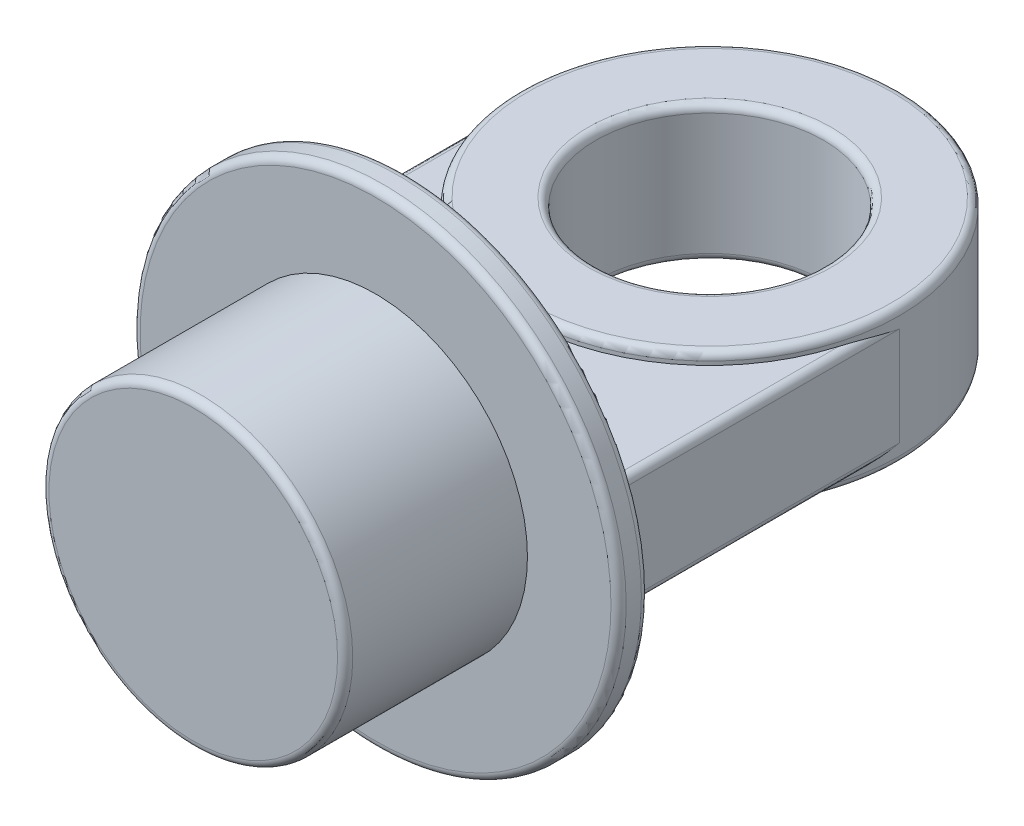
ISO-10303-21;
HEADER;
FILE_DESCRIPTION(('STEP AP214'),'2;1');
FILE_NAME('part.step','',(''),(''),'','','');
FILE_SCHEMA(('AUTOMOTIVE_DESIGN { 1 0 10303 214 1 1 1 1 }'));
ENDSEC;
DATA;
#1=APPLICATION_CONTEXT('core data for automotive mechanical design processes');
#2=APPLICATION_PROTOCOL_DEFINITION('international standard','automotive_design',2000,#1);
#3=PRODUCT_CONTEXT('',#1,'mechanical');
#4=PRODUCT('Part','Part','',(#3));
#5=PRODUCT_RELATED_PRODUCT_CATEGORY('part','',(#4));
#6=PRODUCT_DEFINITION_FORMATION('','',#4);
#7=PRODUCT_DEFINITION_CONTEXT('part definition',#1,'design');
#8=PRODUCT_DEFINITION('design','',#6,#7);
#9=PRODUCT_DEFINITION_SHAPE('','',#8);
#10=(LENGTH_UNIT() NAMED_UNIT(*) SI_UNIT(.MILLI.,.METRE.));
#11=(NAMED_UNIT(*) PLANE_ANGLE_UNIT() SI_UNIT($,.RADIAN.));
#12=(NAMED_UNIT(*) SI_UNIT($,.STERADIAN.) SOLID_ANGLE_UNIT());
#13=UNCERTAINTY_MEASURE_WITH_UNIT(LENGTH_MEASURE(1.E-05),#10,'distance_accuracy_value','');
#14=(GEOMETRIC_REPRESENTATION_CONTEXT(3) GLOBAL_UNCERTAINTY_ASSIGNED_CONTEXT((#13)) GLOBAL_UNIT_ASSIGNED_CONTEXT((#10,
#11,#12)) REPRESENTATION_CONTEXT('',''));
#15=CARTESIAN_POINT('',(0.,0.,0.));
#16=DIRECTION('',(0.,0.,1.));
#17=DIRECTION('',(1.,0.,0.));
#18=AXIS2_PLACEMENT_3D('',#15,#16,#17);
#19=CARTESIAN_POINT('',(0.,-45.,0.));
#20=DIRECTION('',(0.,1.,0.));
#21=DIRECTION('',(0.,0.,1.));
#22=AXIS2_PLACEMENT_3D('',#19,#20,#21);
#23=CYLINDRICAL_SURFACE('',#22,125.);
#24=CARTESIAN_POINT('',(0.,-40.,0.));
#25=DIRECTION('',(0.,-1.,0.));
#26=DIRECTION('',(0.,0.,-1.));
#27=AXIS2_PLACEMENT_3D('',#24,#25,#26);
#28=CIRCLE('',#27,125.);
#29=CARTESIAN_POINT('',(0.,-40.,-125.));
#30=VERTEX_POINT('',#29);
#31=EDGE_CURVE('E146',#30,#30,#28,.F.);
#32=ORIENTED_EDGE('',*,*,#31,.T.);
#33=EDGE_LOOP('',(#32));
#34=FACE_BOUND('',#33,.T.);
#35=CARTESIAN_POINT('',(0.,40.,0.));
#36=DIRECTION('',(0.,-1.,0.));
#37=DIRECTION('',(0.,0.,-1.));
#38=AXIS2_PLACEMENT_3D('',#35,#36,#37);
#39=CIRCLE('',#38,125.);
#40=CARTESIAN_POINT('',(0.,40.,-125.));
#41=VERTEX_POINT('',#40);
#42=EDGE_CURVE('E142',#41,#41,#39,.T.);
#43=ORIENTED_EDGE('',*,*,#42,.T.);
#44=EDGE_LOOP('',(#43));
#45=FACE_BOUND('',#44,.T.);
#46=DIRECTION('',(0.,-1.,0.));
#47=VECTOR('',#46,1.);
#48=CARTESIAN_POINT('',(-125.,37.5,0.));
#49=LINE('',#48,#47);
#50=CARTESIAN_POINT('',(-125.,32.5,0.));
#51=VERTEX_POINT('',#50);
#52=CARTESIAN_POINT('',(-125.,-32.5,0.));
#53=VERTEX_POINT('',#52);
#54=EDGE_CURVE('E247',#51,#53,#49,.T.);
#55=ORIENTED_EDGE('',*,*,#54,.F.);
#56=CARTESIAN_POINT('',(-120.,37.5,35.));
#57=CARTESIAN_POINT('',(-120.117159095794,37.4999808232256,34.5983147253606));
#58=CARTESIAN_POINT('',(-120.232295564654,37.4958825259331,34.1960548612005));
#59=CARTESIAN_POINT('',(-120.458480470542,37.4802303675377,33.3905586919555));
#60=CARTESIAN_POINT('',(-120.569529177728,37.4686770000723,32.9873224532824));
#61=CARTESIAN_POINT('',(-120.787467824642,37.4388231461597,32.1801540822831));
#62=CARTESIAN_POINT('',(-120.894359405792,37.4205253532395,31.7762222917521));
#63=CARTESIAN_POINT('',(-121.104011239872,37.3777660673464,30.9676109099602));
#64=CARTESIAN_POINT('',(-121.206771410033,37.3533044509589,30.5629313038874));
#65=CARTESIAN_POINT('',(-121.508680895321,37.2715180852205,29.3485265121441));
#66=CARTESIAN_POINT('',(-121.701628090091,37.2057669851474,28.5378096451051));
#67=CARTESIAN_POINT('',(-122.070943985269,37.0553182619087,26.9142697010779));
#68=CARTESIAN_POINT('',(-122.247309925297,36.9706174919825,26.1014462964642));
#69=CARTESIAN_POINT('',(-122.631195530929,36.7588252746109,24.2430988206619));
#70=CARTESIAN_POINT('',(-122.833335717648,36.6265266795731,23.197054029651));
#71=CARTESIAN_POINT('',(-123.210382654959,36.3404971226216,21.1029307266817));
#72=CARTESIAN_POINT('',(-123.385286722184,36.1867640517559,20.0548520246234));
#73=CARTESIAN_POINT('',(-123.708041630681,35.8619729192063,17.9568183366304));
#74=CARTESIAN_POINT('',(-123.855882385753,35.6909084350415,16.9068627978279));
#75=CARTESIAN_POINT('',(-124.124562476187,35.3350769456564,14.805894352514));
#76=CARTESIAN_POINT('',(-124.245402716773,35.150310400091,13.7548814826379));
#77=CARTESIAN_POINT('',(-124.567739362015,34.5800572213472,10.5995817746101));
#78=CARTESIAN_POINT('',(-124.728913909028,34.1787615341394,8.4939313998974));
#79=CARTESIAN_POINT('',(-124.944431159831,33.3562720458198,4.28185675073339));
#80=CARTESIAN_POINT('',(-124.998812679493,32.9350855314142,2.17543303590089));
#81=CARTESIAN_POINT('',(-124.999993587987,32.5092449944652,0.0462249779827598));
#82=CARTESIAN_POINT('',(-124.999999998181,32.5046224925326,0.0231124685030197));
#83=CARTESIAN_POINT('',(-125.,32.5,0.));
#84=B_SPLINE_CURVE_WITH_KNOTS('',3,(#56,#57,#58,#59,#60,#61,#62,#63,#64,#65,#66,#67,#68,#69,#70,
#71,#72,#73,#74,#75,#76,#77,#78,#79,#80,#81,#82,#83),.UNSPECIFIED.,.F.,.F.,(4,2,2,2,2,2,2,2,2,2,
2,2,2,4),(0.,1.25522063281108,2.51035815973579,3.76499496347897,5.01965689006302,
7.52703603605919,10.0348318640549,13.2549203873241,16.4753259610632,19.6969293120883,
22.9184246387726,29.3641700102804,35.8075721242576,35.8782828049911),.UNSPECIFIED.);
#85=CARTESIAN_POINT('',(-120.,37.5,35.));
#86=VERTEX_POINT('',#85);
#87=EDGE_CURVE('E192',#51,#86,#84,.F.);
#88=ORIENTED_EDGE('',*,*,#87,.T.);
#89=CARTESIAN_POINT('',(0.,37.5,0.));
#90=DIRECTION('',(0.,-1.,0.));
#91=DIRECTION('',(1.,0.,0.));
#92=AXIS2_PLACEMENT_3D('',#89,#90,#91);
#93=CIRCLE('',#92,125.);
#94=CARTESIAN_POINT('',(120.,37.5,35.));
#95=VERTEX_POINT('',#94);
#96=EDGE_CURVE('E253',#95,#86,#93,.T.);
#97=ORIENTED_EDGE('',*,*,#96,.F.);
#98=CARTESIAN_POINT('',(120.,37.5,35.));
#99=CARTESIAN_POINT('',(120.117159095794,37.4999808232256,34.5983147253593));
#100=CARTESIAN_POINT('',(120.232295564654,37.495882525933,34.1960548611978));
#101=CARTESIAN_POINT('',(120.458480470544,37.4802303675376,33.3905586919501));
#102=CARTESIAN_POINT('',(120.569529177729,37.4686770000721,32.9873224532756));
#103=CARTESIAN_POINT('',(120.787467824645,37.4388231461593,32.1801540822739));
#104=CARTESIAN_POINT('',(120.894359405795,37.420525353239,31.7762222917418));
#105=CARTESIAN_POINT('',(121.104011239875,37.3777660673456,30.9676109099478));
#106=CARTESIAN_POINT('',(121.206771410036,37.353304450958,30.5629313038739));
#107=CARTESIAN_POINT('',(121.508680895324,37.2715180852195,29.3485265121322));
#108=CARTESIAN_POINT('',(121.701628090093,37.2057669851466,28.5378096450958));
#109=CARTESIAN_POINT('',(122.07094398527,37.0553182619082,26.9142697010736));
#110=CARTESIAN_POINT('',(122.247309925298,36.9706174919821,26.1014462964622));
#111=CARTESIAN_POINT('',(122.631195530929,36.7588252746109,24.2430988206627));
#112=CARTESIAN_POINT('',(122.833335717648,36.6265266795734,23.1970540296523));
#113=CARTESIAN_POINT('',(123.210382654959,36.3404971226218,21.1029307266841));
#114=CARTESIAN_POINT('',(123.385286722183,36.1867640517558,20.0548520246266));
#115=CARTESIAN_POINT('',(123.70804163068,35.8619729192076,17.9568183366355));
#116=CARTESIAN_POINT('',(123.855882385752,35.6909084350446,16.9068627978345));
#117=CARTESIAN_POINT('',(124.124562476185,35.3350769456562,14.8058943525245));
#118=CARTESIAN_POINT('',(124.245402716772,35.1503104000857,13.7548814826509));
#119=CARTESIAN_POINT('',(124.567739362014,34.5800572213641,10.5995817746185));
#120=CARTESIAN_POINT('',(124.728913909027,34.1787615342215,8.49393139989094));
#121=CARTESIAN_POINT('',(124.944431159831,33.3562720457405,4.28185675075479));
#122=CARTESIAN_POINT('',(124.998812679493,32.9350855311083,2.17543303596495));
#123=CARTESIAN_POINT('',(124.999993587987,32.5092449944585,0.046224977984321));
#124=CARTESIAN_POINT('',(124.999999998181,32.5046224925293,0.0231124685039194));
#125=CARTESIAN_POINT('',(125.,32.5,2.42861286636753E-13));
#126=B_SPLINE_CURVE_WITH_KNOTS('',3,(#98,#99,#100,#101,#102,#103,#104,#105,#106,#107,#108,#109,
#110,#111,#112,#113,#114,#115,#116,#117,#118,#119,#120,#121,#122,#123,#124,#125),.UNSPECIFIED.,
.F.,.F.,(4,2,2,2,2,2,2,2,2,2,2,2,2,4),(0.,1.2552206328153,2.51035815974422,3.76499496349069,
5.01965689007802,7.52703603606594,10.0348318640546,13.2549203873223,16.4753259610596,
19.6969293120795,22.9184246387594,29.3641700102724,35.8075721242574,35.8782828049908),.UNSPECIFIED.);
#127=CARTESIAN_POINT('',(125.,32.5,2.4980018054066E-13));
#128=VERTEX_POINT('',#127);
#129=EDGE_CURVE('E26',#95,#128,#126,.T.);
#130=ORIENTED_EDGE('',*,*,#129,.T.);
#131=DIRECTION('',(0.,-1.,0.));
#132=VECTOR('',#131,1.);
#133=CARTESIAN_POINT('',(125.,37.5,2.4980018054066E-13));
#134=LINE('',#133,#132);
#135=CARTESIAN_POINT('',(125.,-32.5,2.4980018054066E-13));
#136=VERTEX_POINT('',#135);
#137=EDGE_CURVE('E252',#128,#136,#134,.T.);
#138=ORIENTED_EDGE('',*,*,#137,.T.);
#139=CARTESIAN_POINT('',(120.,-37.5,35.));
#140=CARTESIAN_POINT('',(120.117159095794,-37.4999808232256,34.5983147253593));
#141=CARTESIAN_POINT('',(120.232295564654,-37.4958825259331,34.1960548611977));
#142=CARTESIAN_POINT('',(120.458480470544,-37.4802303675376,33.39055869195));
#143=CARTESIAN_POINT('',(120.569529177729,-37.4686770000721,32.9873224532755));
#144=CARTESIAN_POINT('',(120.787467824645,-37.4388231461594,32.1801540822738));
#145=CARTESIAN_POINT('',(120.894359405795,-37.420525353239,31.7762222917417));
#146=CARTESIAN_POINT('',(121.104011239875,-37.3777660673457,30.9676109099476));
#147=CARTESIAN_POINT('',(121.206771410037,-37.3533044509581,30.5629313038737));
#148=CARTESIAN_POINT('',(121.508680895324,-37.2715180852196,29.348526512132));
#149=CARTESIAN_POINT('',(121.701628090093,-37.2057669851468,28.5378096450957));
#150=CARTESIAN_POINT('',(122.07094398527,-37.0553182619084,26.9142697010736));
#151=CARTESIAN_POINT('',(122.247309925298,-36.9706174919822,26.1014462964622));
#152=CARTESIAN_POINT('',(122.631195530929,-36.758825274611,24.2430988206627));
#153=CARTESIAN_POINT('',(122.833335717648,-36.6265266795736,23.1970540296522));
#154=CARTESIAN_POINT('',(123.210382654959,-36.3404971226222,21.102930726684));
#155=CARTESIAN_POINT('',(123.385286722183,-36.1867640517562,20.0548520246265));
#156=CARTESIAN_POINT('',(123.70804163068,-35.8619729192081,17.9568183366355));
#157=CARTESIAN_POINT('',(123.855882385752,-35.6909084350451,16.9068627978344));
#158=CARTESIAN_POINT('',(124.124562476185,-35.3350769456567,14.8058943525244));
#159=CARTESIAN_POINT('',(124.245402716772,-35.1503104000861,13.7548814826509));
#160=CARTESIAN_POINT('',(124.567739362014,-34.5800572213652,10.5995817746183));
#161=CARTESIAN_POINT('',(124.728913909027,-34.1787615342243,8.49393139989036));
#162=CARTESIAN_POINT('',(124.944431159831,-33.3562720457405,4.28185675075467));
#163=CARTESIAN_POINT('',(124.998812679493,-32.9350855311038,2.17543303596566));
#164=CARTESIAN_POINT('',(124.999993587987,-32.5092449944584,0.0462249779840844));
#165=CARTESIAN_POINT('',(124.999999998181,-32.5046224925292,0.0231124685036798));
#166=CARTESIAN_POINT('',(125.,-32.5,0.));
#167=B_SPLINE_CURVE_WITH_KNOTS('',3,(#139,#140,#141,#142,#143,#144,#145,#146,#147,#148,#149,
#150,#151,#152,#153,#154,#155,#156,#157,#158,#159,#160,#161,#162,#163,#164,#165,#166),
.UNSPECIFIED.,.F.,.F.,(4,2,2,2,2,2,2,2,2,2,2,2,2,4),(0.,1.25522063281538,2.51035815974436,
3.76499496349086,5.01965689007825,7.52703603606604,10.0348318640546,13.2549203873223,
16.4753259610596,19.6969293120795,22.9184246387593,29.3641700102725,35.8075721242577,
35.8782828049911),.UNSPECIFIED.);
#168=CARTESIAN_POINT('',(120.,-37.5,35.));
#169=VERTEX_POINT('',#168);
#170=EDGE_CURVE('E33',#136,#169,#167,.F.);
#171=ORIENTED_EDGE('',*,*,#170,.T.);
#172=CARTESIAN_POINT('',(0.,-37.5,0.));
#173=DIRECTION('',(0.,-1.,0.));
#174=DIRECTION('',(1.,0.,0.));
#175=AXIS2_PLACEMENT_3D('',#172,#173,#174);
#176=CIRCLE('',#175,125.);
#177=CARTESIAN_POINT('',(-120.,-37.5,35.));
#178=VERTEX_POINT('',#177);
#179=EDGE_CURVE('E105',#169,#178,#176,.T.);
#180=ORIENTED_EDGE('',*,*,#179,.T.);
#181=CARTESIAN_POINT('',(-120.,-37.5,35.));
#182=CARTESIAN_POINT('',(-120.117159095794,-37.4999808232256,34.5983147253606));
#183=CARTESIAN_POINT('',(-120.232295564654,-37.4958825259331,34.1960548612005));
#184=CARTESIAN_POINT('',(-120.458480470542,-37.4802303675377,33.3905586919555));
#185=CARTESIAN_POINT('',(-120.569529177728,-37.4686770000723,32.9873224532824));
#186=CARTESIAN_POINT('',(-120.787467824642,-37.4388231461597,32.1801540822831));
#187=CARTESIAN_POINT('',(-120.894359405792,-37.4205253532395,31.7762222917521));
#188=CARTESIAN_POINT('',(-121.104011239872,-37.3777660673464,30.9676109099602));
#189=CARTESIAN_POINT('',(-121.206771410033,-37.3533044509589,30.5629313038874));
#190=CARTESIAN_POINT('',(-121.508680895321,-37.2715180852205,29.3485265121441));
#191=CARTESIAN_POINT('',(-121.701628090091,-37.2057669851474,28.5378096451051));
#192=CARTESIAN_POINT('',(-122.070943985269,-37.0553182619087,26.9142697010779));
#193=CARTESIAN_POINT('',(-122.247309925297,-36.9706174919825,26.1014462964642));
#194=CARTESIAN_POINT('',(-122.631195530929,-36.7588252746109,24.2430988206619));
#195=CARTESIAN_POINT('',(-122.833335717648,-36.6265266795731,23.197054029651));
#196=CARTESIAN_POINT('',(-123.210382654959,-36.3404971226216,21.1029307266817));
#197=CARTESIAN_POINT('',(-123.385286722184,-36.1867640517559,20.0548520246234));
#198=CARTESIAN_POINT('',(-123.708041630681,-35.8619729192063,17.9568183366304));
#199=CARTESIAN_POINT('',(-123.855882385753,-35.6909084350415,16.9068627978279));
#200=CARTESIAN_POINT('',(-124.124562476187,-35.3350769456564,14.805894352514));
#201=CARTESIAN_POINT('',(-124.245402716773,-35.150310400091,13.7548814826379));
#202=CARTESIAN_POINT('',(-124.567739362015,-34.5800572213472,10.5995817746101));
#203=CARTESIAN_POINT('',(-124.728913909028,-34.1787615341393,8.4939313998974));
#204=CARTESIAN_POINT('',(-124.944431159831,-33.3562720458198,4.28185675073339));
#205=CARTESIAN_POINT('',(-124.998812679493,-32.9350855314142,2.17543303590089));
#206=CARTESIAN_POINT('',(-124.999993587987,-32.5092449944652,0.0462249779827595));
#207=CARTESIAN_POINT('',(-124.999999998181,-32.5046224925326,0.0231124685030195));
#208=CARTESIAN_POINT('',(-125.,-32.5,0.));
#209=B_SPLINE_CURVE_WITH_KNOTS('',3,(#181,#182,#183,#184,#185,#186,#187,#188,#189,#190,#191,
#192,#193,#194,#195,#196,#197,#198,#199,#200,#201,#202,#203,#204,#205,#206,#207,#208),
.UNSPECIFIED.,.F.,.F.,(4,2,2,2,2,2,2,2,2,2,2,2,2,4),(0.,1.25522063281108,2.51035815973579,
3.76499496347897,5.01965689006303,7.5270360360592,10.0348318640549,13.2549203873241,
16.4753259610632,19.6969293120883,22.9184246387726,29.3641700102804,35.8075721242576,
35.8782828049911),.UNSPECIFIED.);
#210=EDGE_CURVE('E95',#178,#53,#209,.T.);
#211=ORIENTED_EDGE('',*,*,#210,.T.);
#212=EDGE_LOOP('',(#55,#88,#97,#130,#138,#171,#180,#211));
#213=FACE_BOUND('',#212,.T.);
#214=ADVANCED_FACE('F17',(#34,#45,#213),#23,.T.);
#215=CARTESIAN_POINT('',(0.,-45.,0.));
#216=DIRECTION('',(0.,1.,0.));
#217=DIRECTION('',(0.,0.,1.));
#218=AXIS2_PLACEMENT_3D('',#215,#216,#217);
#219=CYLINDRICAL_SURFACE('',#218,75.);
#220=CARTESIAN_POINT('',(0.,-40.,0.));
#221=DIRECTION('',(0.,-1.,0.));
#222=DIRECTION('',(0.,0.,-1.));
#223=AXIS2_PLACEMENT_3D('',#220,#221,#222);
#224=CIRCLE('',#223,75.);
#225=CARTESIAN_POINT('',(0.,-40.,-75.));
#226=VERTEX_POINT('',#225);
#227=EDGE_CURVE('E154',#226,#226,#224,.T.);
#228=ORIENTED_EDGE('',*,*,#227,.T.);
#229=EDGE_LOOP('',(#228));
#230=FACE_BOUND('',#229,.T.);
#231=CARTESIAN_POINT('',(0.,40.,0.));
#232=DIRECTION('',(0.,-1.,0.));
#233=DIRECTION('',(0.,0.,-1.));
#234=AXIS2_PLACEMENT_3D('',#231,#232,#233);
#235=CIRCLE('',#234,75.);
#236=CARTESIAN_POINT('',(0.,40.,-75.));
#237=VERTEX_POINT('',#236);
#238=EDGE_CURVE('E150',#237,#237,#235,.F.);
#239=ORIENTED_EDGE('',*,*,#238,.T.);
#240=EDGE_LOOP('',(#239));
#241=FACE_BOUND('',#240,.T.);
#242=ADVANCED_FACE('F235',(#230,#241),#219,.F.);
#243=CARTESIAN_POINT('',(0.,-45.,0.));
#244=DIRECTION('',(0.,-1.,0.));
#245=DIRECTION('',(0.,0.,-1.));
#246=AXIS2_PLACEMENT_3D('',#243,#244,#245);
#247=PLANE('',#246);
#248=CARTESIAN_POINT('',(0.,-45.,0.));
#249=DIRECTION('',(0.,-1.,0.));
#250=DIRECTION('',(0.,0.,-1.));
#251=AXIS2_PLACEMENT_3D('',#248,#249,#250);
#252=CIRCLE('',#251,120.);
#253=CARTESIAN_POINT('',(0.,-45.,-120.));
#254=VERTEX_POINT('',#253);
#255=EDGE_CURVE('E138',#254,#254,#252,.T.);
#256=ORIENTED_EDGE('',*,*,#255,.T.);
#257=EDGE_LOOP('',(#256));
#258=FACE_BOUND('',#257,.T.);
#259=CARTESIAN_POINT('',(0.,-45.,0.));
#260=DIRECTION('',(0.,-1.,0.));
#261=DIRECTION('',(0.,0.,-1.));
#262=AXIS2_PLACEMENT_3D('',#259,#260,#261);
#263=CIRCLE('',#262,80.);
#264=CARTESIAN_POINT('',(0.,-45.,-80.));
#265=VERTEX_POINT('',#264);
#266=EDGE_CURVE('E134',#265,#265,#263,.F.);
#267=ORIENTED_EDGE('',*,*,#266,.T.);
#268=EDGE_LOOP('',(#267));
#269=FACE_BOUND('',#268,.T.);
#270=ADVANCED_FACE('F240',(#258,#269),#247,.T.);
#271=CARTESIAN_POINT('',(0.,45.,0.));
#272=DIRECTION('',(0.,-1.,0.));
#273=DIRECTION('',(0.,0.,-1.));
#274=AXIS2_PLACEMENT_3D('',#271,#272,#273);
#275=PLANE('',#274);
#276=CARTESIAN_POINT('',(0.,45.,0.));
#277=DIRECTION('',(0.,-1.,0.));
#278=DIRECTION('',(0.,0.,-1.));
#279=AXIS2_PLACEMENT_3D('',#276,#277,#278);
#280=CIRCLE('',#279,120.);
#281=CARTESIAN_POINT('',(0.,45.,-120.));
#282=VERTEX_POINT('',#281);
#283=EDGE_CURVE('E96',#282,#282,#280,.F.);
#284=ORIENTED_EDGE('',*,*,#283,.T.);
#285=EDGE_LOOP('',(#284));
#286=FACE_BOUND('',#285,.T.);
#287=CARTESIAN_POINT('',(0.,45.,0.));
#288=DIRECTION('',(0.,-1.,0.));
#289=DIRECTION('',(0.,0.,-1.));
#290=AXIS2_PLACEMENT_3D('',#287,#288,#289);
#291=CIRCLE('',#290,80.);
#292=CARTESIAN_POINT('',(0.,45.,-80.));
#293=VERTEX_POINT('',#292);
#294=EDGE_CURVE('E158',#293,#293,#291,.T.);
#295=ORIENTED_EDGE('',*,*,#294,.T.);
#296=EDGE_LOOP('',(#295));
#297=FACE_BOUND('',#296,.T.);
#298=ADVANCED_FACE('F315',(#286,#297),#275,.F.);
#299=CARTESIAN_POINT('',(-125.,37.5,0.));
#300=DIRECTION('',(1.,0.,0.));
#301=DIRECTION('',(0.,0.,-1.));
#302=AXIS2_PLACEMENT_3D('',#299,#300,#301);
#303=PLANE('',#302);
#304=ORIENTED_EDGE('',*,*,#54,.T.);
#305=DIRECTION('',(0.,0.,1.));
#306=VECTOR('',#305,1.);
#307=CARTESIAN_POINT('',(-125.,-32.5,200.));
#308=LINE('',#307,#306);
#309=CARTESIAN_POINT('',(-125.,-32.5,200.));
#310=VERTEX_POINT('',#309);
#311=EDGE_CURVE('E121',#53,#310,#308,.T.);
#312=ORIENTED_EDGE('',*,*,#311,.T.);
#313=DIRECTION('',(0.,-1.,0.));
#314=VECTOR('',#313,1.);
#315=CARTESIAN_POINT('',(-125.,37.5,200.));
#316=LINE('',#315,#314);
#317=CARTESIAN_POINT('',(-125.,32.5,200.));
#318=VERTEX_POINT('',#317);
#319=EDGE_CURVE('E89',#318,#310,#316,.T.);
#320=ORIENTED_EDGE('',*,*,#319,.F.);
#321=DIRECTION('',(0.,0.,1.));
#322=VECTOR('',#321,1.);
#323=CARTESIAN_POINT('',(-125.,32.5,0.));
#324=LINE('',#323,#322);
#325=EDGE_CURVE('E257',#318,#51,#324,.F.);
#326=ORIENTED_EDGE('',*,*,#325,.T.);
#327=EDGE_LOOP('',(#304,#312,#320,#326));
#328=FACE_BOUND('',#327,.T.);
#329=ADVANCED_FACE('F312',(#328),#303,.F.);
#330=CARTESIAN_POINT('',(125.,37.5,200.));
#331=DIRECTION('',(-1.,0.,0.));
#332=DIRECTION('',(0.,0.,1.));
#333=AXIS2_PLACEMENT_3D('',#330,#331,#332);
#334=PLANE('',#333);
#335=DIRECTION('',(0.,-1.,0.));
#336=VECTOR('',#335,1.);
#337=CARTESIAN_POINT('',(125.,37.5,200.));
#338=LINE('',#337,#336);
#339=CARTESIAN_POINT('',(125.,32.5,200.));
#340=VERTEX_POINT('',#339);
#341=CARTESIAN_POINT('',(125.,-32.5,200.));
#342=VERTEX_POINT('',#341);
#343=EDGE_CURVE('E278',#340,#342,#338,.T.);
#344=ORIENTED_EDGE('',*,*,#343,.T.);
#345=DIRECTION('',(0.,0.,-1.));
#346=VECTOR('',#345,1.);
#347=CARTESIAN_POINT('',(125.,-32.5,2.5951463200613E-13));
#348=LINE('',#347,#346);
#349=EDGE_CURVE('E131',#342,#136,#348,.T.);
#350=ORIENTED_EDGE('',*,*,#349,.T.);
#351=ORIENTED_EDGE('',*,*,#137,.F.);
#352=DIRECTION('',(0.,0.,-1.));
#353=VECTOR('',#352,1.);
#354=CARTESIAN_POINT('',(125.,32.5,200.));
#355=LINE('',#354,#353);
#356=EDGE_CURVE('E128',#128,#340,#355,.F.);
#357=ORIENTED_EDGE('',*,*,#356,.T.);
#358=EDGE_LOOP('',(#344,#350,#351,#357));
#359=FACE_BOUND('',#358,.T.);
#360=ADVANCED_FACE('F314',(#359),#334,.F.);
#361=CARTESIAN_POINT('',(0.,37.5,0.));
#362=DIRECTION('',(0.,-1.,0.));
#363=DIRECTION('',(0.,0.,-1.));
#364=AXIS2_PLACEMENT_3D('',#361,#362,#363);
#365=PLANE('',#364);
#366=ORIENTED_EDGE('',*,*,#96,.T.);
#367=DIRECTION('',(0.,0.,1.));
#368=VECTOR('',#367,1.);
#369=CARTESIAN_POINT('',(-120.,37.5,0.));
#370=LINE('',#369,#368);
#371=CARTESIAN_POINT('',(-120.,37.5,200.));
#372=VERTEX_POINT('',#371);
#373=EDGE_CURVE('E119',#86,#372,#370,.T.);
#374=ORIENTED_EDGE('',*,*,#373,.T.);
#375=DIRECTION('',(1.,0.,0.));
#376=VECTOR('',#375,1.);
#377=CARTESIAN_POINT('',(-125.,37.5,200.));
#378=LINE('',#377,#376);
#379=CARTESIAN_POINT('',(120.,37.5,200.));
#380=VERTEX_POINT('',#379);
#381=EDGE_CURVE('E262',#372,#380,#378,.T.);
#382=ORIENTED_EDGE('',*,*,#381,.T.);
#383=DIRECTION('',(0.,0.,-1.));
#384=VECTOR('',#383,1.);
#385=CARTESIAN_POINT('',(120.,37.5,2.33146835171283E-13));
#386=LINE('',#385,#384);
#387=EDGE_CURVE('E111',#380,#95,#386,.T.);
#388=ORIENTED_EDGE('',*,*,#387,.T.);
#389=EDGE_LOOP('',(#366,#374,#382,#388));
#390=FACE_BOUND('',#389,.T.);
#391=ADVANCED_FACE('F261',(#390),#365,.F.);
#392=CARTESIAN_POINT('',(0.,-37.5,0.));
#393=DIRECTION('',(0.,-1.,0.));
#394=DIRECTION('',(0.,0.,-1.));
#395=AXIS2_PLACEMENT_3D('',#392,#393,#394);
#396=PLANE('',#395);
#397=DIRECTION('',(1.,0.,0.));
#398=VECTOR('',#397,1.);
#399=CARTESIAN_POINT('',(-125.,-37.5,200.));
#400=LINE('',#399,#398);
#401=CARTESIAN_POINT('',(-120.,-37.5,200.));
#402=VERTEX_POINT('',#401);
#403=CARTESIAN_POINT('',(120.,-37.5,200.));
#404=VERTEX_POINT('',#403);
#405=EDGE_CURVE('E86',#402,#404,#400,.T.);
#406=ORIENTED_EDGE('',*,*,#405,.F.);
#407=DIRECTION('',(0.,0.,1.));
#408=VECTOR('',#407,1.);
#409=CARTESIAN_POINT('',(-120.,-37.5,0.));
#410=LINE('',#409,#408);
#411=EDGE_CURVE('E101',#402,#178,#410,.F.);
#412=ORIENTED_EDGE('',*,*,#411,.T.);
#413=ORIENTED_EDGE('',*,*,#179,.F.);
#414=DIRECTION('',(0.,0.,-1.));
#415=VECTOR('',#414,1.);
#416=CARTESIAN_POINT('',(120.,-37.5,200.));
#417=LINE('',#416,#415);
#418=EDGE_CURVE('E103',#169,#404,#417,.F.);
#419=ORIENTED_EDGE('',*,*,#418,.T.);
#420=EDGE_LOOP('',(#406,#412,#413,#419));
#421=FACE_BOUND('',#420,.T.);
#422=ADVANCED_FACE('F99',(#421),#396,.T.);
#423=CARTESIAN_POINT('',(0.,0.,200.));
#424=DIRECTION('',(0.,0.,1.));
#425=DIRECTION('',(1.,0.,0.));
#426=AXIS2_PLACEMENT_3D('',#423,#424,#425);
#427=PLANE('',#426);
#428=CARTESIAN_POINT('',(0.,0.,200.));
#429=DIRECTION('',(0.,0.,1.));
#430=DIRECTION('',(1.,0.,0.));
#431=AXIS2_PLACEMENT_3D('',#428,#429,#430);
#432=CIRCLE('',#431,155.);
#433=CARTESIAN_POINT('',(155.,0.,200.));
#434=VERTEX_POINT('',#433);
#435=EDGE_CURVE('E304',#434,#434,#432,.F.);
#436=ORIENTED_EDGE('',*,*,#435,.T.);
#437=EDGE_LOOP('',(#436));
#438=FACE_BOUND('',#437,.T.);
#439=ORIENTED_EDGE('',*,*,#319,.T.);
#440=CARTESIAN_POINT('',(-120.,-32.5,200.));
#441=DIRECTION('',(0.,0.,1.));
#442=DIRECTION('',(1.,0.,0.));
#443=AXIS2_PLACEMENT_3D('',#440,#441,#442);
#444=CIRCLE('',#443,5.);
#445=EDGE_CURVE('E83',#310,#402,#444,.T.);
#446=ORIENTED_EDGE('',*,*,#445,.T.);
#447=ORIENTED_EDGE('',*,*,#405,.T.);
#448=CARTESIAN_POINT('',(120.,-32.5,200.));
#449=DIRECTION('',(0.,0.,1.));
#450=DIRECTION('',(1.,0.,0.));
#451=AXIS2_PLACEMENT_3D('',#448,#449,#450);
#452=CIRCLE('',#451,5.);
#453=EDGE_CURVE('E205',#404,#342,#452,.T.);
#454=ORIENTED_EDGE('',*,*,#453,.T.);
#455=ORIENTED_EDGE('',*,*,#343,.F.);
#456=CARTESIAN_POINT('',(120.,32.5,200.));
#457=DIRECTION('',(0.,0.,1.));
#458=DIRECTION('',(1.,0.,0.));
#459=AXIS2_PLACEMENT_3D('',#456,#457,#458);
#460=CIRCLE('',#459,5.);
#461=EDGE_CURVE('E10',#340,#380,#460,.T.);
#462=ORIENTED_EDGE('',*,*,#461,.T.);
#463=ORIENTED_EDGE('',*,*,#381,.F.);
#464=CARTESIAN_POINT('',(-120.,32.5,200.));
#465=DIRECTION('',(0.,0.,1.));
#466=DIRECTION('',(1.,0.,0.));
#467=AXIS2_PLACEMENT_3D('',#464,#465,#466);
#468=CIRCLE('',#467,5.);
#469=EDGE_CURVE('E173',#372,#318,#468,.T.);
#470=ORIENTED_EDGE('',*,*,#469,.T.);
#471=EDGE_LOOP('',(#439,#446,#447,#454,#455,#462,#463,#470));
#472=FACE_BOUND('',#471,.T.);
#473=ADVANCED_FACE('F85',(#438,#472),#427,.F.);
#474=CARTESIAN_POINT('',(0.,0.,220.));
#475=DIRECTION('',(0.,0.,-1.));
#476=DIRECTION('',(-1.,0.,0.));
#477=AXIS2_PLACEMENT_3D('',#474,#475,#476);
#478=CYLINDRICAL_SURFACE('',#477,160.);
#479=CARTESIAN_POINT('',(0.,0.,215.));
#480=DIRECTION('',(0.,0.,1.));
#481=DIRECTION('',(1.,0.,0.));
#482=AXIS2_PLACEMENT_3D('',#479,#480,#481);
#483=CIRCLE('',#482,160.);
#484=CARTESIAN_POINT('',(160.,0.,215.));
#485=VERTEX_POINT('',#484);
#486=EDGE_CURVE('E300',#485,#485,#483,.F.);
#487=ORIENTED_EDGE('',*,*,#486,.T.);
#488=EDGE_LOOP('',(#487));
#489=FACE_BOUND('',#488,.T.);
#490=CARTESIAN_POINT('',(0.,0.,205.));
#491=DIRECTION('',(0.,0.,1.));
#492=DIRECTION('',(1.,0.,0.));
#493=AXIS2_PLACEMENT_3D('',#490,#491,#492);
#494=CIRCLE('',#493,160.);
#495=CARTESIAN_POINT('',(160.,0.,205.));
#496=VERTEX_POINT('',#495);
#497=EDGE_CURVE('E296',#496,#496,#494,.T.);
#498=ORIENTED_EDGE('',*,*,#497,.T.);
#499=EDGE_LOOP('',(#498));
#500=FACE_BOUND('',#499,.T.);
#501=ADVANCED_FACE('F395',(#489,#500),#478,.T.);
#502=CARTESIAN_POINT('',(0.,0.,220.));
#503=DIRECTION('',(0.,0.,1.));
#504=DIRECTION('',(1.,0.,0.));
#505=AXIS2_PLACEMENT_3D('',#502,#503,#504);
#506=PLANE('',#505);
#507=CARTESIAN_POINT('',(0.,0.,220.));
#508=DIRECTION('',(0.,0.,1.));
#509=DIRECTION('',(1.,0.,0.));
#510=AXIS2_PLACEMENT_3D('',#507,#508,#509);
#511=CIRCLE('',#510,155.);
#512=CARTESIAN_POINT('',(155.,0.,220.));
#513=VERTEX_POINT('',#512);
#514=EDGE_CURVE('E292',#513,#513,#511,.T.);
#515=ORIENTED_EDGE('',*,*,#514,.T.);
#516=EDGE_LOOP('',(#515));
#517=FACE_BOUND('',#516,.T.);
#518=CARTESIAN_POINT('',(0.,0.,220.));
#519=DIRECTION('',(0.,0.,1.));
#520=DIRECTION('',(1.,0.,0.));
#521=AXIS2_PLACEMENT_3D('',#518,#519,#520);
#522=CIRCLE('',#521,100.);
#523=CARTESIAN_POINT('',(100.,0.,220.));
#524=VERTEX_POINT('',#523);
#525=EDGE_CURVE('E106',#524,#524,#522,.T.);
#526=ORIENTED_EDGE('',*,*,#525,.F.);
#527=EDGE_LOOP('',(#526));
#528=FACE_BOUND('',#527,.T.);
#529=ADVANCED_FACE('F406',(#517,#528),#506,.T.);
#530=CARTESIAN_POINT('',(0.,0.,340.));
#531=DIRECTION('',(0.,0.,1.));
#532=DIRECTION('',(1.,0.,0.));
#533=AXIS2_PLACEMENT_3D('',#530,#531,#532);
#534=PLANE('',#533);
#535=CARTESIAN_POINT('',(0.,0.,340.));
#536=DIRECTION('',(0.,0.,1.));
#537=DIRECTION('',(1.,0.,0.));
#538=AXIS2_PLACEMENT_3D('',#535,#536,#537);
#539=CIRCLE('',#538,95.);
#540=CARTESIAN_POINT('',(95.,0.,340.));
#541=VERTEX_POINT('',#540);
#542=EDGE_CURVE('E283',#541,#541,#539,.T.);
#543=ORIENTED_EDGE('',*,*,#542,.T.);
#544=EDGE_LOOP('',(#543));
#545=FACE_BOUND('',#544,.T.);
#546=ADVANCED_FACE('F417',(#545),#534,.T.);
#547=CARTESIAN_POINT('',(0.,0.,340.));
#548=DIRECTION('',(0.,0.,-1.));
#549=DIRECTION('',(-1.,0.,0.));
#550=AXIS2_PLACEMENT_3D('',#547,#548,#549);
#551=CYLINDRICAL_SURFACE('',#550,100.);
#552=CARTESIAN_POINT('',(0.,0.,335.));
#553=DIRECTION('',(0.,0.,1.));
#554=DIRECTION('',(1.,0.,0.));
#555=AXIS2_PLACEMENT_3D('',#552,#553,#554);
#556=CIRCLE('',#555,100.);
#557=CARTESIAN_POINT('',(100.,0.,335.));
#558=VERTEX_POINT('',#557);
#559=EDGE_CURVE('E288',#558,#558,#556,.F.);
#560=ORIENTED_EDGE('',*,*,#559,.T.);
#561=EDGE_LOOP('',(#560));
#562=FACE_BOUND('',#561,.T.);
#563=ORIENTED_EDGE('',*,*,#525,.T.);
#564=EDGE_LOOP('',(#563));
#565=FACE_BOUND('',#564,.T.);
#566=ADVANCED_FACE('F428',(#562,#565),#551,.T.);
#567=CARTESIAN_POINT('',(0.,0.,335.));
#568=DIRECTION('',(0.,0.,1.));
#569=DIRECTION('',(1.,0.,0.));
#570=AXIS2_PLACEMENT_3D('',#567,#568,#569);
#571=TOROIDAL_SURFACE('',#570,95.,5.);
#572=ORIENTED_EDGE('',*,*,#559,.F.);
#573=EDGE_LOOP('',(#572));
#574=FACE_BOUND('',#573,.T.);
#575=ORIENTED_EDGE('',*,*,#542,.F.);
#576=EDGE_LOOP('',(#575));
#577=FACE_BOUND('',#576,.T.);
#578=ADVANCED_FACE('F439',(#574,#577),#571,.T.);
#579=CARTESIAN_POINT('',(0.,0.,215.));
#580=DIRECTION('',(0.,0.,1.));
#581=DIRECTION('',(1.,0.,0.));
#582=AXIS2_PLACEMENT_3D('',#579,#580,#581);
#583=TOROIDAL_SURFACE('',#582,155.,5.);
#584=ORIENTED_EDGE('',*,*,#486,.F.);
#585=EDGE_LOOP('',(#584));
#586=FACE_BOUND('',#585,.T.);
#587=ORIENTED_EDGE('',*,*,#514,.F.);
#588=EDGE_LOOP('',(#587));
#589=FACE_BOUND('',#588,.T.);
#590=ADVANCED_FACE('F450',(#586,#589),#583,.T.);
#591=CARTESIAN_POINT('',(0.,0.,205.));
#592=DIRECTION('',(0.,0.,1.));
#593=DIRECTION('',(1.,0.,0.));
#594=AXIS2_PLACEMENT_3D('',#591,#592,#593);
#595=TOROIDAL_SURFACE('',#594,155.,5.);
#596=ORIENTED_EDGE('',*,*,#435,.F.);
#597=EDGE_LOOP('',(#596));
#598=FACE_BOUND('',#597,.T.);
#599=ORIENTED_EDGE('',*,*,#497,.F.);
#600=EDGE_LOOP('',(#599));
#601=FACE_BOUND('',#600,.T.);
#602=ADVANCED_FACE('F183',(#598,#601),#595,.T.);
#603=CARTESIAN_POINT('',(-120.,-32.5,0.));
#604=DIRECTION('',(0.,0.,-1.));
#605=DIRECTION('',(-1.,0.,0.));
#606=AXIS2_PLACEMENT_3D('',#603,#604,#605);
#607=CYLINDRICAL_SURFACE('',#606,5.);
#608=ORIENTED_EDGE('',*,*,#210,.F.);
#609=ORIENTED_EDGE('',*,*,#411,.F.);
#610=ORIENTED_EDGE('',*,*,#445,.F.);
#611=ORIENTED_EDGE('',*,*,#311,.F.);
#612=EDGE_LOOP('',(#608,#609,#610,#611));
#613=FACE_BOUND('',#612,.T.);
#614=ADVANCED_FACE('F109',(#613),#607,.T.);
#615=CARTESIAN_POINT('',(-120.,32.5,0.));
#616=DIRECTION('',(0.,0.,1.));
#617=DIRECTION('',(1.,0.,0.));
#618=AXIS2_PLACEMENT_3D('',#615,#616,#617);
#619=CYLINDRICAL_SURFACE('',#618,5.);
#620=ORIENTED_EDGE('',*,*,#87,.F.);
#621=ORIENTED_EDGE('',*,*,#325,.F.);
#622=ORIENTED_EDGE('',*,*,#469,.F.);
#623=ORIENTED_EDGE('',*,*,#373,.F.);
#624=EDGE_LOOP('',(#620,#621,#622,#623));
#625=FACE_BOUND('',#624,.T.);
#626=ADVANCED_FACE('F182',(#625),#619,.T.);
#627=CARTESIAN_POINT('',(120.,-32.5,200.));
#628=DIRECTION('',(0.,0.,1.));
#629=DIRECTION('',(1.,0.,0.));
#630=AXIS2_PLACEMENT_3D('',#627,#628,#629);
#631=CYLINDRICAL_SURFACE('',#630,5.);
#632=ORIENTED_EDGE('',*,*,#453,.F.);
#633=ORIENTED_EDGE('',*,*,#418,.F.);
#634=ORIENTED_EDGE('',*,*,#170,.F.);
#635=ORIENTED_EDGE('',*,*,#349,.F.);
#636=EDGE_LOOP('',(#632,#633,#634,#635));
#637=FACE_BOUND('',#636,.T.);
#638=ADVANCED_FACE('F188',(#637),#631,.T.);
#639=CARTESIAN_POINT('',(120.,32.5,2.33146835171283E-13));
#640=DIRECTION('',(0.,0.,-1.));
#641=DIRECTION('',(-1.,0.,0.));
#642=AXIS2_PLACEMENT_3D('',#639,#640,#641);
#643=CYLINDRICAL_SURFACE('',#642,5.);
#644=ORIENTED_EDGE('',*,*,#461,.F.);
#645=ORIENTED_EDGE('',*,*,#356,.F.);
#646=ORIENTED_EDGE('',*,*,#129,.F.);
#647=ORIENTED_EDGE('',*,*,#387,.F.);
#648=EDGE_LOOP('',(#644,#645,#646,#647));
#649=FACE_BOUND('',#648,.T.);
#650=ADVANCED_FACE('F212',(#649),#643,.T.);
#651=CARTESIAN_POINT('',(0.,-40.,0.));
#652=DIRECTION('',(0.,-1.,0.));
#653=DIRECTION('',(0.,0.,-1.));
#654=AXIS2_PLACEMENT_3D('',#651,#652,#653);
#655=TOROIDAL_SURFACE('',#654,120.,5.);
#656=ORIENTED_EDGE('',*,*,#31,.F.);
#657=EDGE_LOOP('',(#656));
#658=FACE_BOUND('',#657,.T.);
#659=ORIENTED_EDGE('',*,*,#255,.F.);
#660=EDGE_LOOP('',(#659));
#661=FACE_BOUND('',#660,.T.);
#662=ADVANCED_FACE('F216',(#658,#661),#655,.T.);
#663=CARTESIAN_POINT('',(0.,-40.,0.));
#664=DIRECTION('',(0.,-1.,0.));
#665=DIRECTION('',(0.,0.,-1.));
#666=AXIS2_PLACEMENT_3D('',#663,#664,#665);
#667=TOROIDAL_SURFACE('',#666,80.,5.);
#668=ORIENTED_EDGE('',*,*,#266,.F.);
#669=EDGE_LOOP('',(#668));
#670=FACE_BOUND('',#669,.T.);
#671=ORIENTED_EDGE('',*,*,#227,.F.);
#672=EDGE_LOOP('',(#671));
#673=FACE_BOUND('',#672,.T.);
#674=ADVANCED_FACE('F220',(#670,#673),#667,.T.);
#675=CARTESIAN_POINT('',(0.,40.,0.));
#676=DIRECTION('',(0.,-1.,0.));
#677=DIRECTION('',(0.,0.,-1.));
#678=AXIS2_PLACEMENT_3D('',#675,#676,#677);
#679=TOROIDAL_SURFACE('',#678,120.,5.);
#680=ORIENTED_EDGE('',*,*,#283,.F.);
#681=EDGE_LOOP('',(#680));
#682=FACE_BOUND('',#681,.T.);
#683=ORIENTED_EDGE('',*,*,#42,.F.);
#684=EDGE_LOOP('',(#683));
#685=FACE_BOUND('',#684,.T.);
#686=ADVANCED_FACE('F223',(#682,#685),#679,.T.);
#687=CARTESIAN_POINT('',(0.,40.,0.));
#688=DIRECTION('',(0.,-1.,0.));
#689=DIRECTION('',(0.,0.,-1.));
#690=AXIS2_PLACEMENT_3D('',#687,#688,#689);
#691=TOROIDAL_SURFACE('',#690,80.,5.);
#692=ORIENTED_EDGE('',*,*,#238,.F.);
#693=EDGE_LOOP('',(#692));
#694=FACE_BOUND('',#693,.T.);
#695=ORIENTED_EDGE('',*,*,#294,.F.);
#696=EDGE_LOOP('',(#695));
#697=FACE_BOUND('',#696,.T.);
#698=ADVANCED_FACE('F19',(#694,#697),#691,.T.);
#699=CLOSED_SHELL('',(#214,#242,#270,#298,#329,#360,#391,#422,#473,#501,#529,#546,#566,#578,
#590,#602,#614,#626,#638,#650,#662,#674,#686,#698));
#700=MANIFOLD_SOLID_BREP('B1',#699);
#701=ADVANCED_BREP_SHAPE_REPRESENTATION('',(#18,#700),#14);
#702=SHAPE_DEFINITION_REPRESENTATION(#9,#701);
ENDSEC;
END-ISO-10303-21;
